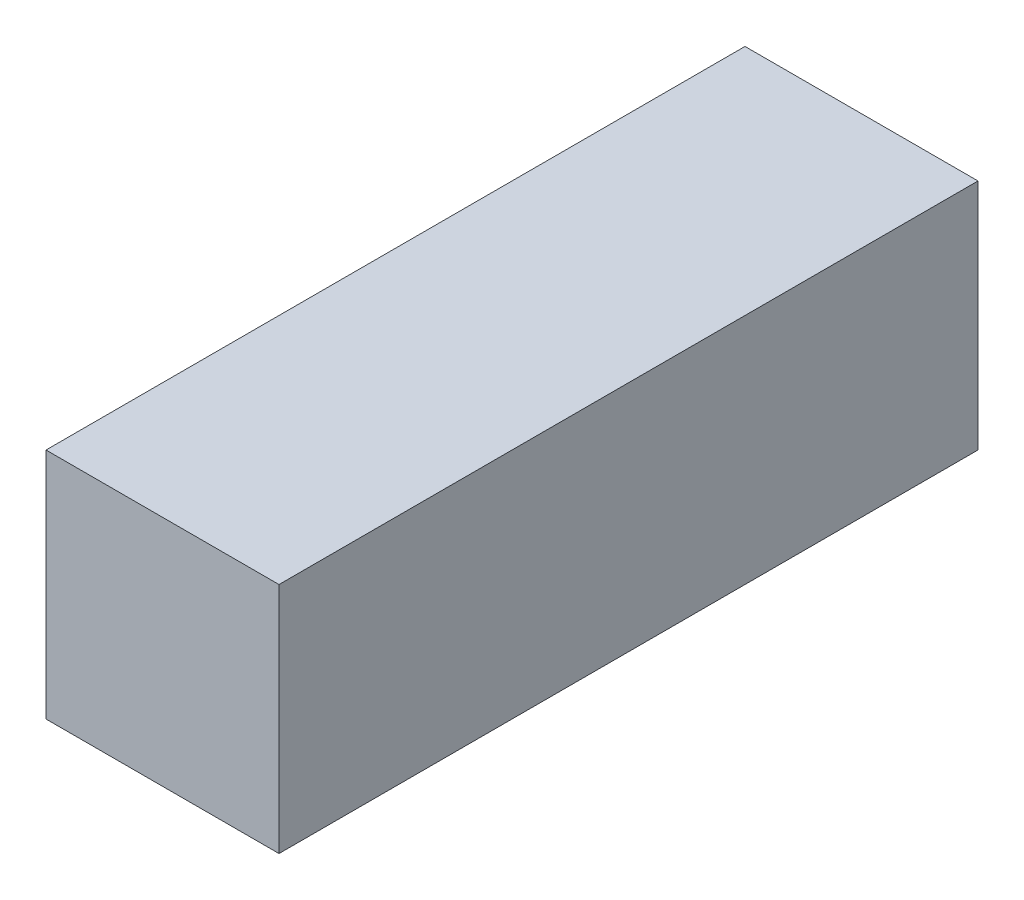
ISO-10303-21;
HEADER;
FILE_DESCRIPTION(('STEP AP214'),'2;1');
FILE_NAME('part.step','',(''),(''),'','','');
FILE_SCHEMA(('AUTOMOTIVE_DESIGN { 1 0 10303 214 1 1 1 1 }'));
ENDSEC;
DATA;
#1=APPLICATION_CONTEXT('core data for automotive mechanical design processes');
#2=APPLICATION_PROTOCOL_DEFINITION('international standard','automotive_design',2000,#1);
#3=PRODUCT_CONTEXT('',#1,'mechanical');
#4=PRODUCT('Part','Part','',(#3));
#5=PRODUCT_RELATED_PRODUCT_CATEGORY('part','',(#4));
#6=PRODUCT_DEFINITION_FORMATION('','',#4);
#7=PRODUCT_DEFINITION_CONTEXT('part definition',#1,'design');
#8=PRODUCT_DEFINITION('design','',#6,#7);
#9=PRODUCT_DEFINITION_SHAPE('','',#8);
#10=(LENGTH_UNIT() NAMED_UNIT(*) SI_UNIT(.MILLI.,.METRE.));
#11=(NAMED_UNIT(*) PLANE_ANGLE_UNIT() SI_UNIT($,.RADIAN.));
#12=(NAMED_UNIT(*) SI_UNIT($,.STERADIAN.) SOLID_ANGLE_UNIT());
#13=UNCERTAINTY_MEASURE_WITH_UNIT(LENGTH_MEASURE(1.E-05),#10,'distance_accuracy_value','');
#14=(GEOMETRIC_REPRESENTATION_CONTEXT(3) GLOBAL_UNCERTAINTY_ASSIGNED_CONTEXT((#13)) GLOBAL_UNIT_ASSIGNED_CONTEXT((#10,
#11,#12)) REPRESENTATION_CONTEXT('',''));
#15=CARTESIAN_POINT('',(0.,0.,0.));
#16=DIRECTION('',(0.,0.,1.));
#17=DIRECTION('',(1.,0.,0.));
#18=AXIS2_PLACEMENT_3D('',#15,#16,#17);
#19=CARTESIAN_POINT('',(-57.5041571107132,200.,-559.038134660862));
#20=DIRECTION('',(1.,0.,0.));
#21=DIRECTION('',(0.,0.,-1.));
#22=AXIS2_PLACEMENT_3D('',#19,#20,#21);
#23=PLANE('',#22);
#24=DIRECTION('',(0.,0.,1.));
#25=VECTOR('',#24,1.);
#26=CARTESIAN_POINT('',(-57.5041571107132,0.,-559.038134660862));
#27=LINE('',#26,#25);
#28=CARTESIAN_POINT('',(-57.5041571107132,0.,-559.038134660862));
#29=VERTEX_POINT('',#28);
#30=CARTESIAN_POINT('',(-57.5041571107131,0.,40.9618653391381));
#31=VERTEX_POINT('',#30);
#32=EDGE_CURVE('E100',#29,#31,#27,.T.);
#33=ORIENTED_EDGE('',*,*,#32,.T.);
#34=DIRECTION('',(0.,-1.,0.));
#35=VECTOR('',#34,1.);
#36=CARTESIAN_POINT('',(-57.5041571107131,200.,40.9618653391381));
#37=LINE('',#36,#35);
#38=CARTESIAN_POINT('',(-57.5041571107131,200.,40.9618653391381));
#39=VERTEX_POINT('',#38);
#40=EDGE_CURVE('E11',#39,#31,#37,.T.);
#41=ORIENTED_EDGE('',*,*,#40,.F.);
#42=DIRECTION('',(0.,0.,1.));
#43=VECTOR('',#42,1.);
#44=CARTESIAN_POINT('',(-57.5041571107132,200.,-559.038134660862));
#45=LINE('',#44,#43);
#46=CARTESIAN_POINT('',(-57.5041571107132,200.,-559.038134660862));
#47=VERTEX_POINT('',#46);
#48=EDGE_CURVE('E88',#47,#39,#45,.T.);
#49=ORIENTED_EDGE('',*,*,#48,.F.);
#50=DIRECTION('',(0.,-1.,0.));
#51=VECTOR('',#50,1.);
#52=CARTESIAN_POINT('',(-57.5041571107132,200.,-559.038134660862));
#53=LINE('',#52,#51);
#54=EDGE_CURVE('E96',#47,#29,#53,.T.);
#55=ORIENTED_EDGE('',*,*,#54,.T.);
#56=EDGE_LOOP('',(#33,#41,#49,#55));
#57=FACE_BOUND('',#56,.T.);
#58=ADVANCED_FACE('F37',(#57),#23,.F.);
#59=CARTESIAN_POINT('',(-57.5041571107131,200.,40.9618653391381));
#60=DIRECTION('',(0.,0.,-1.));
#61=DIRECTION('',(-1.,0.,0.));
#62=AXIS2_PLACEMENT_3D('',#59,#60,#61);
#63=PLANE('',#62);
#64=DIRECTION('',(1.,0.,0.));
#65=VECTOR('',#64,1.);
#66=CARTESIAN_POINT('',(-57.5041571107131,0.,40.9618653391381));
#67=LINE('',#66,#65);
#68=CARTESIAN_POINT('',(142.495842889287,0.,40.9618653391381));
#69=VERTEX_POINT('',#68);
#70=EDGE_CURVE('E92',#31,#69,#67,.T.);
#71=ORIENTED_EDGE('',*,*,#70,.T.);
#72=DIRECTION('',(0.,-1.,0.));
#73=VECTOR('',#72,1.);
#74=CARTESIAN_POINT('',(142.495842889287,200.,40.9618653391381));
#75=LINE('',#74,#73);
#76=CARTESIAN_POINT('',(142.495842889287,200.,40.9618653391381));
#77=VERTEX_POINT('',#76);
#78=EDGE_CURVE('E45',#77,#69,#75,.T.);
#79=ORIENTED_EDGE('',*,*,#78,.F.);
#80=DIRECTION('',(1.,0.,0.));
#81=VECTOR('',#80,1.);
#82=CARTESIAN_POINT('',(-57.5041571107131,200.,40.9618653391381));
#83=LINE('',#82,#81);
#84=EDGE_CURVE('E83',#39,#77,#83,.T.);
#85=ORIENTED_EDGE('',*,*,#84,.F.);
#86=ORIENTED_EDGE('',*,*,#40,.T.);
#87=EDGE_LOOP('',(#71,#79,#85,#86));
#88=FACE_BOUND('',#87,.T.);
#89=ADVANCED_FACE('F91',(#88),#63,.F.);
#90=CARTESIAN_POINT('',(142.495842889287,200.,-559.038134660862));
#91=DIRECTION('',(-1.,0.,0.));
#92=DIRECTION('',(0.,0.,1.));
#93=AXIS2_PLACEMENT_3D('',#90,#91,#92);
#94=PLANE('',#93);
#95=DIRECTION('',(0.,0.,-1.));
#96=VECTOR('',#95,1.);
#97=CARTESIAN_POINT('',(142.495842889287,0.,-559.038134660862));
#98=LINE('',#97,#96);
#99=CARTESIAN_POINT('',(142.495842889287,0.,-559.038134660862));
#100=VERTEX_POINT('',#99);
#101=EDGE_CURVE('E70',#69,#100,#98,.T.);
#102=ORIENTED_EDGE('',*,*,#101,.T.);
#103=DIRECTION('',(0.,-1.,0.));
#104=VECTOR('',#103,1.);
#105=CARTESIAN_POINT('',(142.495842889287,200.,-559.038134660862));
#106=LINE('',#105,#104);
#107=CARTESIAN_POINT('',(142.495842889287,200.,-559.038134660862));
#108=VERTEX_POINT('',#107);
#109=EDGE_CURVE('E93',#108,#100,#106,.T.);
#110=ORIENTED_EDGE('',*,*,#109,.F.);
#111=DIRECTION('',(0.,0.,-1.));
#112=VECTOR('',#111,1.);
#113=CARTESIAN_POINT('',(142.495842889287,200.,-559.038134660862));
#114=LINE('',#113,#112);
#115=EDGE_CURVE('E86',#77,#108,#114,.T.);
#116=ORIENTED_EDGE('',*,*,#115,.F.);
#117=ORIENTED_EDGE('',*,*,#78,.T.);
#118=EDGE_LOOP('',(#102,#110,#116,#117));
#119=FACE_BOUND('',#118,.T.);
#120=ADVANCED_FACE('F94',(#119),#94,.F.);
#121=CARTESIAN_POINT('',(-57.5041571107132,200.,-559.038134660862));
#122=DIRECTION('',(0.,0.,1.));
#123=DIRECTION('',(1.,0.,0.));
#124=AXIS2_PLACEMENT_3D('',#121,#122,#123);
#125=PLANE('',#124);
#126=DIRECTION('',(-1.,0.,0.));
#127=VECTOR('',#126,1.);
#128=CARTESIAN_POINT('',(-57.5041571107132,0.,-559.038134660862));
#129=LINE('',#128,#127);
#130=EDGE_CURVE('E76',#100,#29,#129,.T.);
#131=ORIENTED_EDGE('',*,*,#130,.T.);
#132=ORIENTED_EDGE('',*,*,#54,.F.);
#133=DIRECTION('',(-1.,0.,0.));
#134=VECTOR('',#133,1.);
#135=CARTESIAN_POINT('',(-57.5041571107132,200.,-559.038134660862));
#136=LINE('',#135,#134);
#137=EDGE_CURVE('E53',#108,#47,#136,.T.);
#138=ORIENTED_EDGE('',*,*,#137,.F.);
#139=ORIENTED_EDGE('',*,*,#109,.T.);
#140=EDGE_LOOP('',(#131,#132,#138,#139));
#141=FACE_BOUND('',#140,.T.);
#142=ADVANCED_FACE('F107',(#141),#125,.F.);
#143=CARTESIAN_POINT('',(0.,200.,0.));
#144=DIRECTION('',(0.,1.,0.));
#145=DIRECTION('',(0.,0.,1.));
#146=AXIS2_PLACEMENT_3D('',#143,#144,#145);
#147=PLANE('',#146);
#148=ORIENTED_EDGE('',*,*,#48,.T.);
#149=ORIENTED_EDGE('',*,*,#84,.T.);
#150=ORIENTED_EDGE('',*,*,#115,.T.);
#151=ORIENTED_EDGE('',*,*,#137,.T.);
#152=EDGE_LOOP('',(#148,#149,#150,#151));
#153=FACE_BOUND('',#152,.T.);
#154=ADVANCED_FACE('F84',(#153),#147,.T.);
#155=CARTESIAN_POINT('',(0.,0.,0.));
#156=DIRECTION('',(0.,1.,0.));
#157=DIRECTION('',(0.,0.,1.));
#158=AXIS2_PLACEMENT_3D('',#155,#156,#157);
#159=PLANE('',#158);
#160=ORIENTED_EDGE('',*,*,#32,.F.);
#161=ORIENTED_EDGE('',*,*,#130,.F.);
#162=ORIENTED_EDGE('',*,*,#101,.F.);
#163=ORIENTED_EDGE('',*,*,#70,.F.);
#164=EDGE_LOOP('',(#160,#161,#162,#163));
#165=FACE_BOUND('',#164,.T.);
#166=ADVANCED_FACE('F110',(#165),#159,.F.);
#167=CLOSED_SHELL('',(#58,#89,#120,#142,#154,#166));
#168=MANIFOLD_SOLID_BREP('B2',#167);
#169=ADVANCED_BREP_SHAPE_REPRESENTATION('',(#18,#168),#14);
#170=SHAPE_DEFINITION_REPRESENTATION(#9,#169);
ENDSEC;
END-ISO-10303-21;
